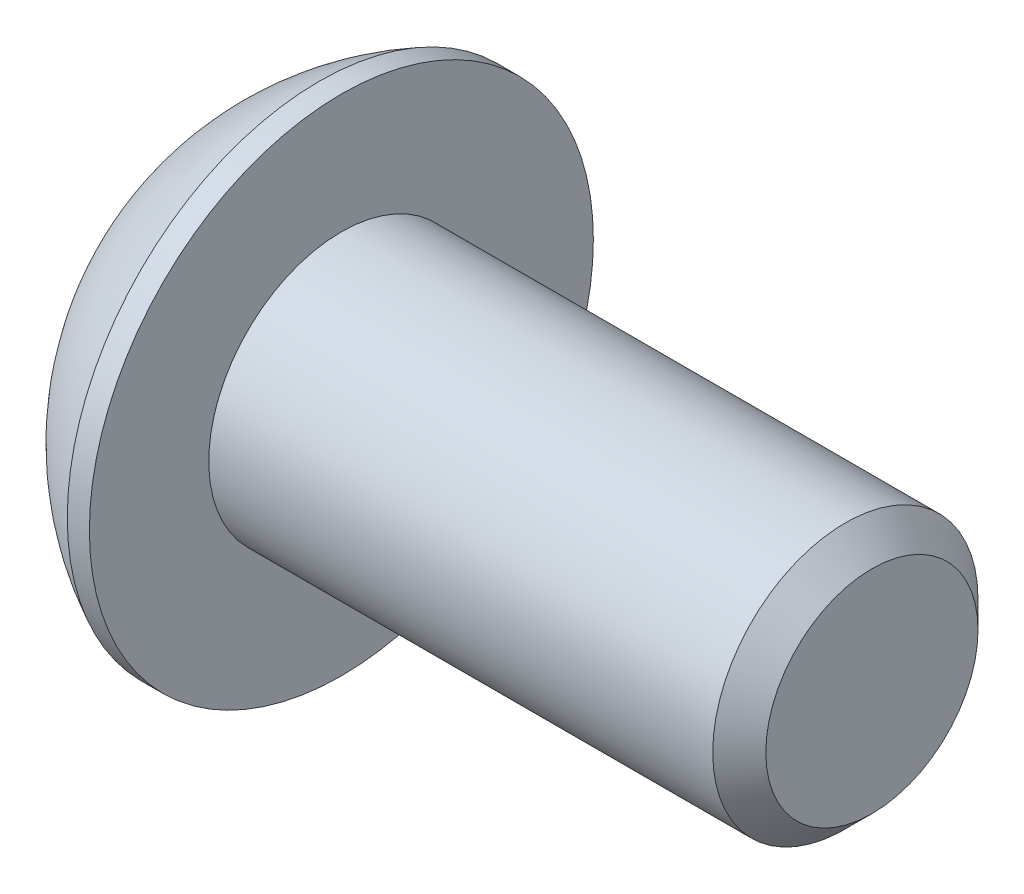
ISO-10303-21;
HEADER;
FILE_DESCRIPTION(('STEP AP214'),'2;1');
FILE_NAME('part.step','',(''),(''),'','','');
FILE_SCHEMA(('AUTOMOTIVE_DESIGN { 1 0 10303 214 1 1 1 1 }'));
ENDSEC;
DATA;
#1=APPLICATION_CONTEXT('core data for automotive mechanical design processes');
#2=APPLICATION_PROTOCOL_DEFINITION('international standard','automotive_design',2000,#1);
#3=PRODUCT_CONTEXT('',#1,'mechanical');
#4=PRODUCT('Part','Part','',(#3));
#5=PRODUCT_RELATED_PRODUCT_CATEGORY('part','',(#4));
#6=PRODUCT_DEFINITION_FORMATION('','',#4);
#7=PRODUCT_DEFINITION_CONTEXT('part definition',#1,'design');
#8=PRODUCT_DEFINITION('design','',#6,#7);
#9=PRODUCT_DEFINITION_SHAPE('','',#8);
#10=(LENGTH_UNIT() NAMED_UNIT(*) SI_UNIT(.MILLI.,.METRE.));
#11=(NAMED_UNIT(*) PLANE_ANGLE_UNIT() SI_UNIT($,.RADIAN.));
#12=(NAMED_UNIT(*) SI_UNIT($,.STERADIAN.) SOLID_ANGLE_UNIT());
#13=UNCERTAINTY_MEASURE_WITH_UNIT(LENGTH_MEASURE(1.E-05),#10,'distance_accuracy_value','');
#14=(GEOMETRIC_REPRESENTATION_CONTEXT(3) GLOBAL_UNCERTAINTY_ASSIGNED_CONTEXT((#13)) GLOBAL_UNIT_ASSIGNED_CONTEXT((#10,
#11,#12)) REPRESENTATION_CONTEXT('',''));
#15=CARTESIAN_POINT('',(0.,0.,0.));
#16=DIRECTION('',(0.,0.,1.));
#17=DIRECTION('',(1.,0.,0.));
#18=AXIS2_PLACEMENT_3D('',#15,#16,#17);
#19=CARTESIAN_POINT('',(-6.,0.,0.));
#20=DIRECTION('',(1.,0.,0.));
#21=DIRECTION('',(0.,0.,-1.));
#22=AXIS2_PLACEMENT_3D('',#19,#20,#21);
#23=CYLINDRICAL_SURFACE('',#22,1.5);
#24=CARTESIAN_POINT('',(-0.300000000000002,0.,0.));
#25=DIRECTION('',(1.,0.,0.));
#26=DIRECTION('',(0.,0.,-1.));
#27=AXIS2_PLACEMENT_3D('',#24,#25,#26);
#28=CIRCLE('',#27,1.5);
#29=CARTESIAN_POINT('',(-0.300000000000002,0.,-1.5));
#30=VERTEX_POINT('',#29);
#31=EDGE_CURVE('E47',#30,#30,#28,.F.);
#32=ORIENTED_EDGE('',*,*,#31,.T.);
#33=EDGE_LOOP('',(#32));
#34=FACE_BOUND('',#33,.T.);
#35=CARTESIAN_POINT('',(-6.,0.,0.));
#36=DIRECTION('',(1.,0.,0.));
#37=DIRECTION('',(0.,1.,0.));
#38=AXIS2_PLACEMENT_3D('',#35,#36,#37);
#39=CIRCLE('',#38,1.5);
#40=CARTESIAN_POINT('',(-6.,1.49999999999999,0.));
#41=VERTEX_POINT('',#40);
#42=EDGE_CURVE('E126',#41,#41,#39,.F.);
#43=ORIENTED_EDGE('',*,*,#42,.F.);
#44=EDGE_LOOP('',(#43));
#45=FACE_BOUND('',#44,.T.);
#46=ADVANCED_FACE('F33',(#34,#45),#23,.T.);
#47=CARTESIAN_POINT('',(0.,0.,0.));
#48=DIRECTION('',(1.,0.,0.));
#49=DIRECTION('',(0.,0.,-1.));
#50=AXIS2_PLACEMENT_3D('',#47,#48,#49);
#51=PLANE('',#50);
#52=CARTESIAN_POINT('',(0.,0.,0.));
#53=DIRECTION('',(1.,0.,0.));
#54=DIRECTION('',(0.,0.,-1.));
#55=AXIS2_PLACEMENT_3D('',#52,#53,#54);
#56=CIRCLE('',#55,1.2);
#57=CARTESIAN_POINT('',(0.,0.,-1.2));
#58=VERTEX_POINT('',#57);
#59=EDGE_CURVE('E129',#58,#58,#56,.T.);
#60=ORIENTED_EDGE('',*,*,#59,.T.);
#61=EDGE_LOOP('',(#60));
#62=FACE_BOUND('',#61,.T.);
#63=ADVANCED_FACE('F139',(#62),#51,.T.);
#64=CARTESIAN_POINT('',(0.,0.,0.));
#65=DIRECTION('',(-1.,0.,0.));
#66=DIRECTION('',(0.,0.,1.));
#67=AXIS2_PLACEMENT_3D('',#64,#65,#66);
#68=CONICAL_SURFACE('',#67,1.2,0.785398163397447);
#69=ORIENTED_EDGE('',*,*,#31,.F.);
#70=EDGE_LOOP('',(#69));
#71=FACE_BOUND('',#70,.T.);
#72=ORIENTED_EDGE('',*,*,#59,.F.);
#73=EDGE_LOOP('',(#72));
#74=FACE_BOUND('',#73,.T.);
#75=ADVANCED_FACE('F35',(#71,#74),#68,.T.);
#76=CARTESIAN_POINT('',(-7.65,0.,0.));
#77=DIRECTION('',(-1.,0.,0.));
#78=DIRECTION('',(0.,-1.,0.));
#79=AXIS2_PLACEMENT_3D('',#76,#77,#78);
#80=PLANE('',#79);
#81=CARTESIAN_POINT('',(-7.65,0.,0.));
#82=DIRECTION('',(-1.,0.,0.));
#83=DIRECTION('',(0.,-1.,0.));
#84=AXIS2_PLACEMENT_3D('',#81,#82,#83);
#85=CIRCLE('',#84,1.20470053837925);
#86=CARTESIAN_POINT('',(-7.65,-1.20470053837926,0.));
#87=VERTEX_POINT('',#86);
#88=EDGE_CURVE('E248',#87,#87,#85,.T.);
#89=ORIENTED_EDGE('',*,*,#88,.F.);
#90=EDGE_LOOP('',(#89));
#91=FACE_BOUND('',#90,.T.);
#92=CARTESIAN_POINT('',(-7.65,0.,0.));
#93=DIRECTION('',(1.,0.,0.));
#94=DIRECTION('',(0.,1.,0.));
#95=AXIS2_PLACEMENT_3D('',#92,#93,#94);
#96=CIRCLE('',#95,1.5);
#97=CARTESIAN_POINT('',(-7.65,1.5,0.));
#98=VERTEX_POINT('',#97);
#99=EDGE_CURVE('E123',#98,#98,#96,.T.);
#100=ORIENTED_EDGE('',*,*,#99,.F.);
#101=EDGE_LOOP('',(#100));
#102=FACE_BOUND('',#101,.T.);
#103=ADVANCED_FACE('F138',(#91,#102),#80,.T.);
#104=CARTESIAN_POINT('',(-4.85267857142857,0.,0.));
#105=DIRECTION('',(1.,0.,0.));
#106=DIRECTION('',(0.,1.,0.));
#107=AXIS2_PLACEMENT_3D('',#104,#105,#106);
#108=SPHERICAL_SURFACE('',#107,3.17411517981703);
#109=ORIENTED_EDGE('',*,*,#99,.T.);
#110=EDGE_LOOP('',(#109));
#111=FACE_BOUND('',#110,.T.);
#112=CARTESIAN_POINT('',(-6.25,0.,0.));
#113=DIRECTION('',(1.,0.,0.));
#114=DIRECTION('',(0.,1.,0.));
#115=AXIS2_PLACEMENT_3D('',#112,#113,#114);
#116=CIRCLE('',#115,2.85);
#117=CARTESIAN_POINT('',(-6.25,2.85,0.));
#118=VERTEX_POINT('',#117);
#119=EDGE_CURVE('E120',#118,#118,#116,.T.);
#120=ORIENTED_EDGE('',*,*,#119,.F.);
#121=EDGE_LOOP('',(#120));
#122=FACE_BOUND('',#121,.T.);
#123=ADVANCED_FACE('F150',(#111,#122),#108,.T.);
#124=CARTESIAN_POINT('',(-6.,0.,0.));
#125=DIRECTION('',(1.,0.,0.));
#126=DIRECTION('',(0.,1.,0.));
#127=AXIS2_PLACEMENT_3D('',#124,#125,#126);
#128=CYLINDRICAL_SURFACE('',#127,2.85);
#129=ORIENTED_EDGE('',*,*,#119,.T.);
#130=EDGE_LOOP('',(#129));
#131=FACE_BOUND('',#130,.T.);
#132=CARTESIAN_POINT('',(-6.,0.,0.));
#133=DIRECTION('',(1.,0.,0.));
#134=DIRECTION('',(0.,1.,0.));
#135=AXIS2_PLACEMENT_3D('',#132,#133,#134);
#136=CIRCLE('',#135,2.85);
#137=CARTESIAN_POINT('',(-6.,2.85,0.));
#138=VERTEX_POINT('',#137);
#139=EDGE_CURVE('E117',#138,#138,#136,.T.);
#140=ORIENTED_EDGE('',*,*,#139,.F.);
#141=EDGE_LOOP('',(#140));
#142=FACE_BOUND('',#141,.T.);
#143=ADVANCED_FACE('F154',(#131,#142),#128,.T.);
#144=CARTESIAN_POINT('',(-6.,2.85,0.));
#145=DIRECTION('',(1.,0.,0.));
#146=DIRECTION('',(0.,1.,0.));
#147=AXIS2_PLACEMENT_3D('',#144,#145,#146);
#148=PLANE('',#147);
#149=ORIENTED_EDGE('',*,*,#42,.T.);
#150=EDGE_LOOP('',(#149));
#151=FACE_BOUND('',#150,.T.);
#152=ORIENTED_EDGE('',*,*,#139,.T.);
#153=EDGE_LOOP('',(#152));
#154=FACE_BOUND('',#153,.T.);
#155=ADVANCED_FACE('F158',(#151,#154),#148,.T.);
#156=CARTESIAN_POINT('',(-7.65,0.,0.));
#157=DIRECTION('',(-1.,0.,0.));
#158=DIRECTION('',(0.,-1.,0.));
#159=AXIS2_PLACEMENT_3D('',#156,#157,#158);
#160=CONICAL_SURFACE('',#159,1.20470053837925,0.78539816339745);
#161=ORIENTED_EDGE('',*,*,#88,.T.);
#162=EDGE_LOOP('',(#161));
#163=FACE_BOUND('',#162,.T.);
#164=CARTESIAN_POINT('',(-8.01256455791632,-1.20678079288096,1.));
#165=CARTESIAN_POINT('',(-7.99012387997521,-1.17763239380937,1.));
#166=CARTESIAN_POINT('',(-7.96788676092706,-1.14832777655038,1.));
#167=CARTESIAN_POINT('',(-7.92390532308587,-1.0893407399734,1.));
#168=CARTESIAN_POINT('',(-7.90216112088704,-1.05965823380996,1.));
#169=CARTESIAN_POINT('',(-7.83748588022217,-0.969511619364377,1.));
#170=CARTESIAN_POINT('',(-7.79545644276499,-0.908390032886407,1.));
#171=CARTESIAN_POINT('',(-7.71242033491187,-0.779849899214033,1.));
#172=CARTESIAN_POINT('',(-7.67164849568708,-0.712278047733961,1.));
#173=CARTESIAN_POINT('',(-7.59670568554025,-0.573692441836178,1.));
#174=CARTESIAN_POINT('',(-7.56251242080364,-0.502691370033589,1.));
#175=CARTESIAN_POINT('',(-7.52066482404941,-0.396633108483667,1.));
#176=CARTESIAN_POINT('',(-7.50875242460105,-0.363265114723095,1.));
#177=CARTESIAN_POINT('',(-7.48760105808146,-0.295675144863692,1.));
#178=CARTESIAN_POINT('',(-7.47836226085427,-0.261453114661031,1.));
#179=CARTESIAN_POINT('',(-7.46321083759311,-0.192964714439426,1.));
#180=CARTESIAN_POINT('',(-7.45723720793528,-0.15871206270243,1.));
#181=CARTESIAN_POINT('',(-7.44873817928594,-0.0897678989597877,1.));
#182=CARTESIAN_POINT('',(-7.44621316916075,-0.0550763379077893,1.));
#183=CARTESIAN_POINT('',(-7.44483082423944,0.0128534343372031,1.));
#184=CARTESIAN_POINT('',(-7.44581713334252,0.0460884918414684,1.));
#185=CARTESIAN_POINT('',(-7.45104282964632,0.112288777523356,1.));
#186=CARTESIAN_POINT('',(-7.45528142282844,0.145254069576928,1.));
#187=CARTESIAN_POINT('',(-7.46684319323882,0.211252641710475,1.));
#188=CARTESIAN_POINT('',(-7.47422139919693,0.244276126106418,1.));
#189=CARTESIAN_POINT('',(-7.49165376330127,0.309593416178908,1.));
#190=CARTESIAN_POINT('',(-7.50170777209373,0.341887262472138,1.));
#191=CARTESIAN_POINT('',(-7.53646926761078,0.441188556116717,1.));
#192=CARTESIAN_POINT('',(-7.56503436033369,0.506841480843489,1.));
#193=CARTESIAN_POINT('',(-7.62860336942529,0.635081389212375,1.));
#194=CARTESIAN_POINT('',(-7.66362995530905,0.697656564069535,1.));
#195=CARTESIAN_POINT('',(-7.73595461078913,0.817274369694624,1.));
#196=CARTESIAN_POINT('',(-7.77305561629113,0.874437672313593,1.));
#197=CARTESIAN_POINT('',(-7.8304371678966,0.958655710303496,1.));
#198=CARTESIAN_POINT('',(-7.84977201892494,0.986366163766962,1.));
#199=CARTESIAN_POINT('',(-7.88896027138788,1.0414069197441,1.));
#200=CARTESIAN_POINT('',(-7.90881352920099,1.06873732439882,1.));
#201=CARTESIAN_POINT('',(-7.92888195229002,1.09590921458871,1.));
#202=B_SPLINE_CURVE_WITH_KNOTS('',3,(#164,#165,#166,#167,#168,#169,#170,#171,#172,#173,#174,
#175,#176,#177,#178,#179,#180,#181,#182,#183,#184,#185,#186,#187,#188,#189,#190,#191,#192,#193,
#194,#195,#196,#197,#198,#199,#200,#201),.UNSPECIFIED.,.F.,.F.,(4,2,2,2,2,2,2,2,2,2,2,2,2,2,2,2,
2,2,4),(0.,0.110355487284534,0.220736811203826,0.443178348562911,0.679759335181114,
0.915523888816462,1.02172703810024,1.1279369325962,1.23208803653002,1.33625088357217,
1.43583459192535,1.53539399546241,1.63677534642523,1.73815103982916,1.95232008261278,
2.16725532249797,2.37159620059983,2.47295962852456,2.57429526618464),.UNSPECIFIED.);
#203=CARTESIAN_POINT('',(-7.6,-0.577350269189629,1.));
#204=VERTEX_POINT('',#203);
#205=CARTESIAN_POINT('',(-7.6,0.577350269189624,1.));
#206=VERTEX_POINT('',#205);
#207=EDGE_CURVE('E101',#204,#206,#202,.T.);
#208=ORIENTED_EDGE('',*,*,#207,.F.);
#209=CARTESIAN_POINT('',(-7.60011548737261,-1.15481600843309,-0.000200000000000086));
#210=CARTESIAN_POINT('',(-7.58027793082573,-1.13496520795026,0.0341825950071807));
#211=CARTESIAN_POINT('',(-7.56160502063889,-1.11478247255942,0.0691401181398249));
#212=CARTESIAN_POINT('',(-7.52741474272316,-1.07362739529219,0.14042280295609));
#213=CARTESIAN_POINT('',(-7.51191640902346,-1.0526511355808,0.176754750528984));
#214=CARTESIAN_POINT('',(-7.48536730714227,-1.01035337909803,0.250016613803311));
#215=CARTESIAN_POINT('',(-7.47424977399693,-0.989042666109243,0.286927851445414));
#216=CARTESIAN_POINT('',(-7.45711986577618,-0.945952199282694,0.361562729310859));
#217=CARTESIAN_POINT('',(-7.45109469746667,-0.924173762626599,0.399284088108636));
#218=CARTESIAN_POINT('',(-7.44566055496749,-0.886641312640017,0.464292198417933));
#219=CARTESIAN_POINT('',(-7.44485693831673,-0.870936130672278,0.491494371528172));
#220=CARTESIAN_POINT('',(-7.44620669941689,-0.839556179862851,0.545846040669112));
#221=CARTESIAN_POINT('',(-7.4483607295472,-0.823881418494927,0.572995523754875));
#222=CARTESIAN_POINT('',(-7.45911697212847,-0.77708097059937,0.65405627732696));
#223=CARTESIAN_POINT('',(-7.47201455641536,-0.746188191116433,0.707564140978427));
#224=CARTESIAN_POINT('',(-7.50314073060218,-0.691968116419652,0.801476065143431));
#225=CARTESIAN_POINT('',(-7.51973779770184,-0.668386557293375,0.842320523671834));
#226=CARTESIAN_POINT('',(-7.55712492468529,-0.622147085933684,0.922409637381944));
#227=CARTESIAN_POINT('',(-7.5779013418174,-0.599486449584578,0.961659010870438));
#228=CARTESIAN_POINT('',(-7.60011548737261,-0.577234799135791,1.0002));
#229=B_SPLINE_CURVE_WITH_KNOTS('',3,(#209,#210,#211,#212,#213,#214,#215,#216,#217,#218,#219,
#220,#221,#222,#223,#224,#225,#226,#227,#228),.UNSPECIFIED.,.F.,.F.,(4,2,2,2,2,2,2,2,2,4),(0.,
0.133237676828559,0.26725222983449,0.3991370762693,0.530689603280768,0.624814864263846,
0.718960890149133,0.907306626112097,1.05710100361789,1.20641411519286),.UNSPECIFIED.);
#230=CARTESIAN_POINT('',(-7.6,-1.15470053837925,0.));
#231=VERTEX_POINT('',#230);
#232=EDGE_CURVE('E204',#231,#204,#229,.T.);
#233=ORIENTED_EDGE('',*,*,#232,.F.);
#234=CARTESIAN_POINT('',(-7.60011548737261,-0.577234799135791,-1.0002));
#235=CARTESIAN_POINT('',(-7.58027793082573,-0.597085599618625,-0.965817404992819));
#236=CARTESIAN_POINT('',(-7.56160502063889,-0.617268335009459,-0.930859881860175));
#237=CARTESIAN_POINT('',(-7.52741474272316,-0.658423412276689,-0.85957719704391));
#238=CARTESIAN_POINT('',(-7.51191640902346,-0.679399671988083,-0.823245249471015));
#239=CARTESIAN_POINT('',(-7.48536730714227,-0.721697428470849,-0.749983386196688));
#240=CARTESIAN_POINT('',(-7.47424977399693,-0.74300814145964,-0.713072148554585));
#241=CARTESIAN_POINT('',(-7.45711986577618,-0.786098608286189,-0.63843727068914));
#242=CARTESIAN_POINT('',(-7.45109469746667,-0.807877044942284,-0.600715911891364));
#243=CARTESIAN_POINT('',(-7.44566055496749,-0.845409494928866,-0.535707801582066));
#244=CARTESIAN_POINT('',(-7.44485693831673,-0.861114676896605,-0.508505628471827));
#245=CARTESIAN_POINT('',(-7.44620669941689,-0.892494627706032,-0.454153959330887));
#246=CARTESIAN_POINT('',(-7.4483607295472,-0.908169389073957,-0.427004476245124));
#247=CARTESIAN_POINT('',(-7.45911697212847,-0.954969836969514,-0.345943722673039));
#248=CARTESIAN_POINT('',(-7.47201455641536,-0.98586261645245,-0.292435859021572));
#249=CARTESIAN_POINT('',(-7.50314073060218,-1.04008269114923,-0.198523934856568));
#250=CARTESIAN_POINT('',(-7.51973779770184,-1.06366425027551,-0.157679476328165));
#251=CARTESIAN_POINT('',(-7.55712492468529,-1.1099037216352,-0.0775903626180561));
#252=CARTESIAN_POINT('',(-7.5779013418174,-1.13256435798431,-0.0383409891295621));
#253=CARTESIAN_POINT('',(-7.60011548737261,-1.15481600843309,0.000200000000000082));
#254=B_SPLINE_CURVE_WITH_KNOTS('',3,(#234,#235,#236,#237,#238,#239,#240,#241,#242,#243,#244,
#245,#246,#247,#248,#249,#250,#251,#252,#253),.UNSPECIFIED.,.F.,.F.,(4,2,2,2,2,2,2,2,2,4),(0.,
0.133237676828559,0.267252229834491,0.3991370762693,0.530689603280769,0.624814864263846,
0.718960890149133,0.907306626112098,1.05710100361789,1.20641411519286),.UNSPECIFIED.);
#255=CARTESIAN_POINT('',(-7.6,-0.577350269189629,-1.));
#256=VERTEX_POINT('',#255);
#257=EDGE_CURVE('E198',#256,#231,#254,.T.);
#258=ORIENTED_EDGE('',*,*,#257,.F.);
#259=CARTESIAN_POINT('',(-8.01256455791632,-1.20678079288096,-1.));
#260=CARTESIAN_POINT('',(-7.99012387997521,-1.17763239380937,-1.));
#261=CARTESIAN_POINT('',(-7.96788676092706,-1.14832777655038,-1.));
#262=CARTESIAN_POINT('',(-7.92390532308587,-1.0893407399734,-1.));
#263=CARTESIAN_POINT('',(-7.90216112088703,-1.05965823380995,-1.));
#264=CARTESIAN_POINT('',(-7.83748588022217,-0.969511619364376,-1.));
#265=CARTESIAN_POINT('',(-7.79545644276499,-0.908390032886406,-1.));
#266=CARTESIAN_POINT('',(-7.71242033491187,-0.779849899214031,-1.));
#267=CARTESIAN_POINT('',(-7.67164849568707,-0.712278047733959,-1.));
#268=CARTESIAN_POINT('',(-7.59670568554025,-0.573692441836176,-1.));
#269=CARTESIAN_POINT('',(-7.56251242080364,-0.502691370033587,-1.));
#270=CARTESIAN_POINT('',(-7.52066482404941,-0.396633108483666,-1.));
#271=CARTESIAN_POINT('',(-7.50875242460105,-0.363265114723094,-1.));
#272=CARTESIAN_POINT('',(-7.48760105808146,-0.295675144863691,-1.));
#273=CARTESIAN_POINT('',(-7.47836226085427,-0.261453114661031,-1.));
#274=CARTESIAN_POINT('',(-7.46321083759311,-0.192964714439425,-1.));
#275=CARTESIAN_POINT('',(-7.45723720793528,-0.158712062702429,-1.));
#276=CARTESIAN_POINT('',(-7.44873817928594,-0.0897678989597872,-1.));
#277=CARTESIAN_POINT('',(-7.44621316916075,-0.0550763379077887,-1.));
#278=CARTESIAN_POINT('',(-7.44483082423944,0.0128534343372036,-1.));
#279=CARTESIAN_POINT('',(-7.44581713334252,0.046088491841469,-1.));
#280=CARTESIAN_POINT('',(-7.45104282964632,0.112288777523357,-1.));
#281=CARTESIAN_POINT('',(-7.45528142282844,0.145254069576929,-1.));
#282=CARTESIAN_POINT('',(-7.46684319323882,0.211252641710475,-1.));
#283=CARTESIAN_POINT('',(-7.47422139919693,0.244276126106418,-1.));
#284=CARTESIAN_POINT('',(-7.49165376330127,0.309593416178908,-1.));
#285=CARTESIAN_POINT('',(-7.50170777209373,0.341887262472138,-1.));
#286=CARTESIAN_POINT('',(-7.53646926761078,0.441188556116717,-1.));
#287=CARTESIAN_POINT('',(-7.56503436033369,0.506841480843489,-1.));
#288=CARTESIAN_POINT('',(-7.62860336942529,0.635081389212375,-1.));
#289=CARTESIAN_POINT('',(-7.66362995530905,0.697656564069534,-1.));
#290=CARTESIAN_POINT('',(-7.73595461078913,0.817274369694624,-1.));
#291=CARTESIAN_POINT('',(-7.77305561629113,0.874437672313593,-1.));
#292=CARTESIAN_POINT('',(-7.83043716789661,0.958655710303497,-1.));
#293=CARTESIAN_POINT('',(-7.84977201892494,0.986366163766964,-1.));
#294=CARTESIAN_POINT('',(-7.88896027138789,1.0414069197441,-1.));
#295=CARTESIAN_POINT('',(-7.908813529201,1.06873732439882,-1.));
#296=CARTESIAN_POINT('',(-7.92888195229002,1.09590921458871,-1.));
#297=B_SPLINE_CURVE_WITH_KNOTS('',3,(#259,#260,#261,#262,#263,#264,#265,#266,#267,#268,#269,
#270,#271,#272,#273,#274,#275,#276,#277,#278,#279,#280,#281,#282,#283,#284,#285,#286,#287,#288,
#289,#290,#291,#292,#293,#294,#295,#296),.UNSPECIFIED.,.F.,.F.,(4,2,2,2,2,2,2,2,2,2,2,2,2,2,2,2,
2,2,4),(0.,0.110355487284534,0.220736811203825,0.44317834856291,0.679759335181115,
0.91552388881646,1.02172703810024,1.12793693259619,1.23208803653002,1.33625088357216,
1.43583459192535,1.53539399546241,1.63677534642523,1.73815103982915,1.95232008261278,
2.16725532249797,2.37159620059983,2.47295962852456,2.57429526618464),.UNSPECIFIED.);
#298=CARTESIAN_POINT('',(-7.6,0.577350269189623,-1.));
#299=VERTEX_POINT('',#298);
#300=EDGE_CURVE('E54',#299,#256,#297,.F.);
#301=ORIENTED_EDGE('',*,*,#300,.F.);
#302=CARTESIAN_POINT('',(-7.60011548737261,1.15481600843309,0.000200000000000269));
#303=CARTESIAN_POINT('',(-7.58027793082573,1.13496520795025,-0.0341825950071805));
#304=CARTESIAN_POINT('',(-7.56160502063889,1.11478247255942,-0.0691401181398247));
#305=CARTESIAN_POINT('',(-7.52741474272316,1.07362739529219,-0.14042280295609));
#306=CARTESIAN_POINT('',(-7.51191640902346,1.0526511355808,-0.176754750528984));
#307=CARTESIAN_POINT('',(-7.48536730714227,1.01035337909803,-0.250016613803311));
#308=CARTESIAN_POINT('',(-7.47424977399693,0.989042666109238,-0.286927851445414));
#309=CARTESIAN_POINT('',(-7.45711986577618,0.945952199282689,-0.361562729310859));
#310=CARTESIAN_POINT('',(-7.45109469746667,0.924173762626594,-0.399284088108636));
#311=CARTESIAN_POINT('',(-7.44566055496749,0.886641312640012,-0.464292198417934));
#312=CARTESIAN_POINT('',(-7.44485693831673,0.870936130672273,-0.491494371528172));
#313=CARTESIAN_POINT('',(-7.44620669941689,0.839556179862846,-0.545846040669112));
#314=CARTESIAN_POINT('',(-7.4483607295472,0.823881418494921,-0.572995523754876));
#315=CARTESIAN_POINT('',(-7.45911697212847,0.777080970599364,-0.65405627732696));
#316=CARTESIAN_POINT('',(-7.47201455641536,0.746188191116428,-0.707564140978428));
#317=CARTESIAN_POINT('',(-7.50314073060218,0.691968116419647,-0.801476065143432));
#318=CARTESIAN_POINT('',(-7.51973779770184,0.668386557293369,-0.842320523671834));
#319=CARTESIAN_POINT('',(-7.55712492468529,0.622147085933679,-0.922409637381944));
#320=CARTESIAN_POINT('',(-7.5779013418174,0.599486449584573,-0.961659010870438));
#321=CARTESIAN_POINT('',(-7.60011548737261,0.577234799135786,-1.0002));
#322=B_SPLINE_CURVE_WITH_KNOTS('',3,(#302,#303,#304,#305,#306,#307,#308,#309,#310,#311,#312,
#313,#314,#315,#316,#317,#318,#319,#320,#321),.UNSPECIFIED.,.F.,.F.,(4,2,2,2,2,2,2,2,2,4),(0.,
0.13323767682856,0.26725222983449,0.399137076269301,0.530689603280769,0.624814864263847,
0.718960890149133,0.907306626112098,1.05710100361789,1.20641411519286),.UNSPECIFIED.);
#323=CARTESIAN_POINT('',(-7.6,1.15470053837925,0.));
#324=VERTEX_POINT('',#323);
#325=EDGE_CURVE('E11',#324,#299,#322,.T.);
#326=ORIENTED_EDGE('',*,*,#325,.F.);
#327=CARTESIAN_POINT('',(-7.60011548737261,0.577234799135786,1.0002));
#328=CARTESIAN_POINT('',(-7.58027793082573,0.597085599618619,0.965817404992819));
#329=CARTESIAN_POINT('',(-7.56160502063889,0.617268335009454,0.930859881860175));
#330=CARTESIAN_POINT('',(-7.52741474272316,0.658423412276684,0.85957719704391));
#331=CARTESIAN_POINT('',(-7.51191640902346,0.679399671988078,0.823245249471016));
#332=CARTESIAN_POINT('',(-7.48536730714227,0.721697428470844,0.749983386196689));
#333=CARTESIAN_POINT('',(-7.47424977399693,0.743008141459634,0.713072148554586));
#334=CARTESIAN_POINT('',(-7.45711986577618,0.786098608286184,0.638437270689141));
#335=CARTESIAN_POINT('',(-7.45109469746667,0.807877044942279,0.600715911891364));
#336=CARTESIAN_POINT('',(-7.44566055496749,0.84540949492886,0.535707801582066));
#337=CARTESIAN_POINT('',(-7.44485693831673,0.861114676896599,0.508505628471828));
#338=CARTESIAN_POINT('',(-7.44620669941689,0.892494627706027,0.454153959330888));
#339=CARTESIAN_POINT('',(-7.4483607295472,0.908169389073952,0.427004476245124));
#340=CARTESIAN_POINT('',(-7.45911697212847,0.954969836969509,0.34594372267304));
#341=CARTESIAN_POINT('',(-7.47201455641536,0.985862616452445,0.292435859021572));
#342=CARTESIAN_POINT('',(-7.50314073060218,1.04008269114923,0.198523934856568));
#343=CARTESIAN_POINT('',(-7.51973779770184,1.0636642502755,0.157679476328165));
#344=CARTESIAN_POINT('',(-7.55712492468529,1.10990372163519,0.077590362618056));
#345=CARTESIAN_POINT('',(-7.5779013418174,1.1325643579843,0.038340989129562));
#346=CARTESIAN_POINT('',(-7.60011548737261,1.15481600843309,-0.000199999999999977));
#347=B_SPLINE_CURVE_WITH_KNOTS('',3,(#327,#328,#329,#330,#331,#332,#333,#334,#335,#336,#337,
#338,#339,#340,#341,#342,#343,#344,#345,#346),.UNSPECIFIED.,.F.,.F.,(4,2,2,2,2,2,2,2,2,4),(0.,
0.133237676828559,0.26725222983449,0.3991370762693,0.530689603280768,0.624814864263846,
0.718960890149133,0.907306626112097,1.05710100361789,1.20641411519286),.UNSPECIFIED.);
#348=EDGE_CURVE('E92',#206,#324,#347,.T.);
#349=ORIENTED_EDGE('',*,*,#348,.F.);
#350=EDGE_LOOP('',(#208,#233,#258,#301,#326,#349));
#351=FACE_BOUND('',#350,.T.);
#352=ADVANCED_FACE('F91',(#163,#351),#160,.F.);
#353=CARTESIAN_POINT('',(-6.45,0.,0.));
#354=DIRECTION('',(-1.,0.,0.));
#355=DIRECTION('',(0.,0.,1.));
#356=AXIS2_PLACEMENT_3D('',#353,#354,#355);
#357=PLANE('',#356);
#358=DIRECTION('',(0.,0.5,-0.866025403784439));
#359=VECTOR('',#358,1.);
#360=CARTESIAN_POINT('',(-6.45,0.577350269189623,1.));
#361=LINE('',#360,#359);
#362=CARTESIAN_POINT('',(-6.45,0.577350269189623,1.));
#363=VERTEX_POINT('',#362);
#364=CARTESIAN_POINT('',(-6.45,1.15470053837925,0.));
#365=VERTEX_POINT('',#364);
#366=EDGE_CURVE('E100',#363,#365,#361,.T.);
#367=ORIENTED_EDGE('',*,*,#366,.T.);
#368=DIRECTION('',(0.,-0.5,-0.866025403784439));
#369=VECTOR('',#368,1.);
#370=CARTESIAN_POINT('',(-6.45,1.15470053837925,0.));
#371=LINE('',#370,#369);
#372=CARTESIAN_POINT('',(-6.45,0.577350269189623,-1.));
#373=VERTEX_POINT('',#372);
#374=EDGE_CURVE('E105',#365,#373,#371,.T.);
#375=ORIENTED_EDGE('',*,*,#374,.T.);
#376=DIRECTION('',(0.,-1.,0.));
#377=VECTOR('',#376,1.);
#378=CARTESIAN_POINT('',(-6.45,0.577350269189623,-1.));
#379=LINE('',#378,#377);
#380=CARTESIAN_POINT('',(-6.45,-0.577350269189629,-1.));
#381=VERTEX_POINT('',#380);
#382=EDGE_CURVE('E230',#373,#381,#379,.T.);
#383=ORIENTED_EDGE('',*,*,#382,.T.);
#384=DIRECTION('',(0.,-0.5,0.866025403784439));
#385=VECTOR('',#384,1.);
#386=CARTESIAN_POINT('',(-6.45,-0.577350269189629,-1.));
#387=LINE('',#386,#385);
#388=CARTESIAN_POINT('',(-6.45,-1.15470053837925,0.));
#389=VERTEX_POINT('',#388);
#390=EDGE_CURVE('E234',#381,#389,#387,.T.);
#391=ORIENTED_EDGE('',*,*,#390,.T.);
#392=DIRECTION('',(0.,0.5,0.866025403784439));
#393=VECTOR('',#392,1.);
#394=CARTESIAN_POINT('',(-6.45,-1.15470053837925,0.));
#395=LINE('',#394,#393);
#396=CARTESIAN_POINT('',(-6.45,-0.577350269189629,1.));
#397=VERTEX_POINT('',#396);
#398=EDGE_CURVE('E113',#389,#397,#395,.T.);
#399=ORIENTED_EDGE('',*,*,#398,.T.);
#400=DIRECTION('',(0.,1.,0.));
#401=VECTOR('',#400,1.);
#402=CARTESIAN_POINT('',(-6.45,-0.577350269189629,1.));
#403=LINE('',#402,#401);
#404=EDGE_CURVE('E108',#397,#363,#403,.T.);
#405=ORIENTED_EDGE('',*,*,#404,.T.);
#406=EDGE_LOOP('',(#367,#375,#383,#391,#399,#405));
#407=FACE_BOUND('',#406,.T.);
#408=ADVANCED_FACE('F184',(#407),#357,.T.);
#409=CARTESIAN_POINT('',(-6.45,1.15470053837925,0.));
#410=DIRECTION('',(0.,0.866025403784439,-0.5));
#411=DIRECTION('',(0.,0.5,0.866025403784439));
#412=AXIS2_PLACEMENT_3D('',#409,#410,#411);
#413=PLANE('',#412);
#414=DIRECTION('',(-1.,0.,0.));
#415=VECTOR('',#414,1.);
#416=CARTESIAN_POINT('',(-6.45,1.15470053837925,0.));
#417=LINE('',#416,#415);
#418=EDGE_CURVE('E98',#365,#324,#417,.T.);
#419=ORIENTED_EDGE('',*,*,#418,.T.);
#420=ORIENTED_EDGE('',*,*,#325,.T.);
#421=DIRECTION('',(-1.,0.,0.));
#422=VECTOR('',#421,1.);
#423=CARTESIAN_POINT('',(-6.45,0.577350269189623,-1.));
#424=LINE('',#423,#422);
#425=EDGE_CURVE('E107',#373,#299,#424,.T.);
#426=ORIENTED_EDGE('',*,*,#425,.F.);
#427=ORIENTED_EDGE('',*,*,#374,.F.);
#428=EDGE_LOOP('',(#419,#420,#426,#427));
#429=FACE_BOUND('',#428,.T.);
#430=ADVANCED_FACE('F103',(#429),#413,.F.);
#431=CARTESIAN_POINT('',(-6.45,0.577350269189623,-1.));
#432=DIRECTION('',(0.,0.,-1.));
#433=DIRECTION('',(-1.,0.,0.));
#434=AXIS2_PLACEMENT_3D('',#431,#432,#433);
#435=PLANE('',#434);
#436=ORIENTED_EDGE('',*,*,#425,.T.);
#437=ORIENTED_EDGE('',*,*,#300,.T.);
#438=DIRECTION('',(-1.,0.,0.));
#439=VECTOR('',#438,1.);
#440=CARTESIAN_POINT('',(-6.45,-0.577350269189629,-1.));
#441=LINE('',#440,#439);
#442=EDGE_CURVE('E110',#381,#256,#441,.T.);
#443=ORIENTED_EDGE('',*,*,#442,.F.);
#444=ORIENTED_EDGE('',*,*,#382,.F.);
#445=EDGE_LOOP('',(#436,#437,#443,#444));
#446=FACE_BOUND('',#445,.T.);
#447=ADVANCED_FACE('F219',(#446),#435,.F.);
#448=CARTESIAN_POINT('',(-6.45,-0.577350269189629,-1.));
#449=DIRECTION('',(0.,-0.866025403784439,-0.5));
#450=DIRECTION('',(0.,0.5,-0.866025403784439));
#451=AXIS2_PLACEMENT_3D('',#448,#449,#450);
#452=PLANE('',#451);
#453=ORIENTED_EDGE('',*,*,#442,.T.);
#454=ORIENTED_EDGE('',*,*,#257,.T.);
#455=DIRECTION('',(-1.,0.,0.));
#456=VECTOR('',#455,1.);
#457=CARTESIAN_POINT('',(-6.45,-1.15470053837925,0.));
#458=LINE('',#457,#456);
#459=EDGE_CURVE('E244',#389,#231,#458,.T.);
#460=ORIENTED_EDGE('',*,*,#459,.F.);
#461=ORIENTED_EDGE('',*,*,#390,.F.);
#462=EDGE_LOOP('',(#453,#454,#460,#461));
#463=FACE_BOUND('',#462,.T.);
#464=ADVANCED_FACE('F214',(#463),#452,.F.);
#465=CARTESIAN_POINT('',(-6.45,-1.15470053837925,0.));
#466=DIRECTION('',(0.,-0.866025403784439,0.5));
#467=DIRECTION('',(0.,-0.5,-0.866025403784439));
#468=AXIS2_PLACEMENT_3D('',#465,#466,#467);
#469=PLANE('',#468);
#470=ORIENTED_EDGE('',*,*,#459,.T.);
#471=ORIENTED_EDGE('',*,*,#232,.T.);
#472=DIRECTION('',(-1.,0.,0.));
#473=VECTOR('',#472,1.);
#474=CARTESIAN_POINT('',(-6.45,-0.577350269189629,1.));
#475=LINE('',#474,#473);
#476=EDGE_CURVE('E241',#397,#204,#475,.T.);
#477=ORIENTED_EDGE('',*,*,#476,.F.);
#478=ORIENTED_EDGE('',*,*,#398,.F.);
#479=EDGE_LOOP('',(#470,#471,#477,#478));
#480=FACE_BOUND('',#479,.T.);
#481=ADVANCED_FACE('F211',(#480),#469,.F.);
#482=CARTESIAN_POINT('',(-6.45,-0.577350269189629,1.));
#483=DIRECTION('',(0.,0.,1.));
#484=DIRECTION('',(1.,0.,0.));
#485=AXIS2_PLACEMENT_3D('',#482,#483,#484);
#486=PLANE('',#485);
#487=ORIENTED_EDGE('',*,*,#476,.T.);
#488=ORIENTED_EDGE('',*,*,#207,.T.);
#489=DIRECTION('',(-1.,0.,0.));
#490=VECTOR('',#489,1.);
#491=CARTESIAN_POINT('',(-6.45,0.577350269189623,1.));
#492=LINE('',#491,#490);
#493=EDGE_CURVE('E61',#363,#206,#492,.T.);
#494=ORIENTED_EDGE('',*,*,#493,.F.);
#495=ORIENTED_EDGE('',*,*,#404,.F.);
#496=EDGE_LOOP('',(#487,#488,#494,#495));
#497=FACE_BOUND('',#496,.T.);
#498=ADVANCED_FACE('F165',(#497),#486,.F.);
#499=CARTESIAN_POINT('',(-6.45,0.577350269189623,1.));
#500=DIRECTION('',(0.,0.866025403784439,0.5));
#501=DIRECTION('',(0.,-0.5,0.866025403784439));
#502=AXIS2_PLACEMENT_3D('',#499,#500,#501);
#503=PLANE('',#502);
#504=ORIENTED_EDGE('',*,*,#493,.T.);
#505=ORIENTED_EDGE('',*,*,#348,.T.);
#506=ORIENTED_EDGE('',*,*,#418,.F.);
#507=ORIENTED_EDGE('',*,*,#366,.F.);
#508=EDGE_LOOP('',(#504,#505,#506,#507));
#509=FACE_BOUND('',#508,.T.);
#510=ADVANCED_FACE('F97',(#509),#503,.F.);
#511=CLOSED_SHELL('',(#46,#63,#75,#103,#123,#143,#155,#352,#408,#430,#447,#464,#481,#498,#510));
#512=MANIFOLD_SOLID_BREP('B2',#511);
#513=ADVANCED_BREP_SHAPE_REPRESENTATION('',(#18,#512),#14);
#514=SHAPE_DEFINITION_REPRESENTATION(#9,#513);
ENDSEC;
END-ISO-10303-21;
